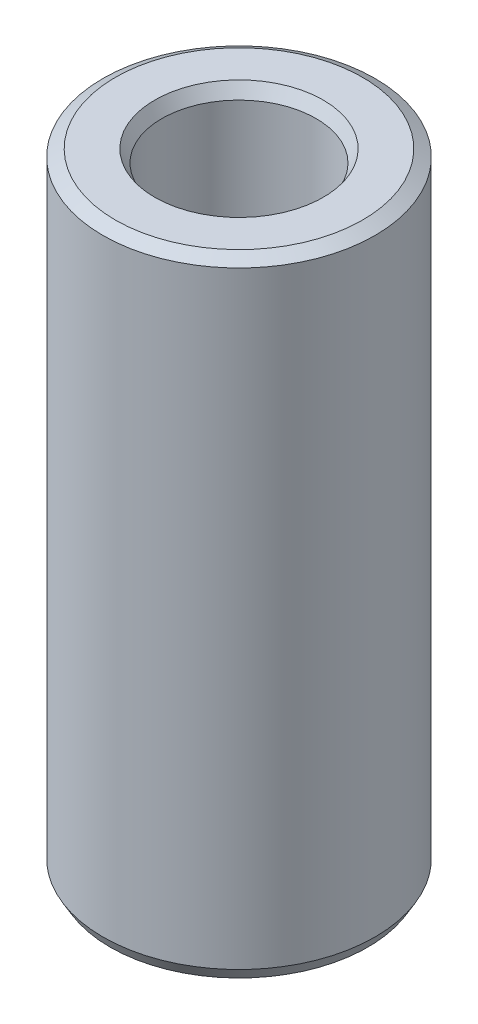
ISO-10303-21;
HEADER;
FILE_DESCRIPTION(('STEP AP214'),'2;1');
FILE_NAME('part.step','',(''),(''),'','','');
FILE_SCHEMA(('AUTOMOTIVE_DESIGN { 1 0 10303 214 1 1 1 1 }'));
ENDSEC;
DATA;
#1=APPLICATION_CONTEXT('core data for automotive mechanical design processes');
#2=APPLICATION_PROTOCOL_DEFINITION('international standard','automotive_design',2000,#1);
#3=PRODUCT_CONTEXT('',#1,'mechanical');
#4=PRODUCT('Part','Part','',(#3));
#5=PRODUCT_RELATED_PRODUCT_CATEGORY('part','',(#4));
#6=PRODUCT_DEFINITION_FORMATION('','',#4);
#7=PRODUCT_DEFINITION_CONTEXT('part definition',#1,'design');
#8=PRODUCT_DEFINITION('design','',#6,#7);
#9=PRODUCT_DEFINITION_SHAPE('','',#8);
#10=(LENGTH_UNIT() NAMED_UNIT(*) SI_UNIT(.MILLI.,.METRE.));
#11=(NAMED_UNIT(*) PLANE_ANGLE_UNIT() SI_UNIT($,.RADIAN.));
#12=(NAMED_UNIT(*) SI_UNIT($,.STERADIAN.) SOLID_ANGLE_UNIT());
#13=UNCERTAINTY_MEASURE_WITH_UNIT(LENGTH_MEASURE(1.E-05),#10,'distance_accuracy_value','');
#14=(GEOMETRIC_REPRESENTATION_CONTEXT(3) GLOBAL_UNCERTAINTY_ASSIGNED_CONTEXT((#13)) GLOBAL_UNIT_ASSIGNED_CONTEXT((#10,
#11,#12)) REPRESENTATION_CONTEXT('',''));
#15=CARTESIAN_POINT('',(0.,0.,0.));
#16=DIRECTION('',(0.,0.,1.));
#17=DIRECTION('',(1.,0.,0.));
#18=AXIS2_PLACEMENT_3D('',#15,#16,#17);
#19=CARTESIAN_POINT('',(0.,69.1482636736106,0.));
#20=DIRECTION('',(0.,-1.,0.));
#21=DIRECTION('',(0.,0.,-1.));
#22=AXIS2_PLACEMENT_3D('',#19,#20,#21);
#23=CYLINDRICAL_SURFACE('',#22,15.);
#24=CARTESIAN_POINT('',(0.,1.36794723579137,0.));
#25=DIRECTION('',(0.,1.,0.));
#26=DIRECTION('',(0.,0.,1.));
#27=AXIS2_PLACEMENT_3D('',#24,#25,#26);
#28=CIRCLE('',#27,15.);
#29=CARTESIAN_POINT('',(0.,1.36794723579137,15.));
#30=VERTEX_POINT('',#29);
#31=EDGE_CURVE('E10',#30,#30,#28,.T.);
#32=ORIENTED_EDGE('',*,*,#31,.T.);
#33=EDGE_LOOP('',(#32));
#34=FACE_BOUND('',#33,.T.);
#35=CARTESIAN_POINT('',(0.,68.3584789687892,0.));
#36=DIRECTION('',(0.,1.,0.));
#37=DIRECTION('',(0.,0.,1.));
#38=AXIS2_PLACEMENT_3D('',#35,#36,#37);
#39=CIRCLE('',#38,15.);
#40=CARTESIAN_POINT('',(0.,68.3584789687892,15.));
#41=VERTEX_POINT('',#40);
#42=EDGE_CURVE('E50',#41,#41,#39,.F.);
#43=ORIENTED_EDGE('',*,*,#42,.T.);
#44=EDGE_LOOP('',(#43));
#45=FACE_BOUND('',#44,.T.);
#46=ADVANCED_FACE('F39',(#34,#45),#23,.T.);
#47=CARTESIAN_POINT('',(0.,69.1482636736106,0.));
#48=DIRECTION('',(0.,1.,0.));
#49=DIRECTION('',(0.,0.,1.));
#50=AXIS2_PLACEMENT_3D('',#47,#48,#49);
#51=PLANE('',#50);
#52=CARTESIAN_POINT('',(0.,69.1482636736106,0.));
#53=DIRECTION('',(0.,1.,0.));
#54=DIRECTION('',(0.,0.,1.));
#55=AXIS2_PLACEMENT_3D('',#52,#53,#54);
#56=CIRCLE('',#55,9.29270970001012);
#57=CARTESIAN_POINT('',(0.,69.1482636736106,9.29270970001012));
#58=VERTEX_POINT('',#57);
#59=EDGE_CURVE('E58',#58,#58,#56,.F.);
#60=ORIENTED_EDGE('',*,*,#59,.T.);
#61=EDGE_LOOP('',(#60));
#62=FACE_BOUND('',#61,.T.);
#63=CARTESIAN_POINT('',(0.,69.1482636736106,0.));
#64=DIRECTION('',(0.,1.,0.));
#65=DIRECTION('',(0.,0.,1.));
#66=AXIS2_PLACEMENT_3D('',#63,#64,#65);
#67=CIRCLE('',#66,13.6320527642086);
#68=CARTESIAN_POINT('',(0.,69.1482636736106,13.6320527642086));
#69=VERTEX_POINT('',#68);
#70=EDGE_CURVE('E61',#69,#69,#67,.T.);
#71=ORIENTED_EDGE('',*,*,#70,.T.);
#72=EDGE_LOOP('',(#71));
#73=FACE_BOUND('',#72,.T.);
#74=ADVANCED_FACE('F88',(#62,#73),#51,.T.);
#75=CARTESIAN_POINT('',(0.,0.,0.));
#76=DIRECTION('',(0.,1.,0.));
#77=DIRECTION('',(0.,0.,1.));
#78=AXIS2_PLACEMENT_3D('',#75,#76,#77);
#79=PLANE('',#78);
#80=CARTESIAN_POINT('',(0.,0.,0.));
#81=DIRECTION('',(0.,1.,0.));
#82=DIRECTION('',(0.,0.,1.));
#83=AXIS2_PLACEMENT_3D('',#80,#81,#82);
#84=CIRCLE('',#83,9.87087223098012);
#85=CARTESIAN_POINT('',(0.,0.,9.87087223098012));
#86=VERTEX_POINT('',#85);
#87=EDGE_CURVE('E51',#86,#86,#84,.T.);
#88=ORIENTED_EDGE('',*,*,#87,.T.);
#89=EDGE_LOOP('',(#88));
#90=FACE_BOUND('',#89,.T.);
#91=CARTESIAN_POINT('',(0.,0.,0.));
#92=DIRECTION('',(0.,1.,0.));
#93=DIRECTION('',(0.,0.,1.));
#94=AXIS2_PLACEMENT_3D('',#91,#92,#93);
#95=CIRCLE('',#94,14.2102152951786);
#96=CARTESIAN_POINT('',(0.,0.,14.2102152951786));
#97=VERTEX_POINT('',#96);
#98=EDGE_CURVE('E54',#97,#97,#95,.F.);
#99=ORIENTED_EDGE('',*,*,#98,.T.);
#100=EDGE_LOOP('',(#99));
#101=FACE_BOUND('',#100,.T.);
#102=ADVANCED_FACE('F83',(#90,#101),#79,.F.);
#103=CARTESIAN_POINT('',(0.,69.1482636736106,0.));
#104=DIRECTION('',(0.,-1.,0.));
#105=DIRECTION('',(0.,0.,-1.));
#106=AXIS2_PLACEMENT_3D('',#103,#104,#105);
#107=CYLINDRICAL_SURFACE('',#106,8.50292499518875);
#108=CARTESIAN_POINT('',(0.,67.7803164378192,0.));
#109=DIRECTION('',(0.,1.,0.));
#110=DIRECTION('',(0.,0.,1.));
#111=AXIS2_PLACEMENT_3D('',#108,#109,#110);
#112=CIRCLE('',#111,8.50292499518875);
#113=CARTESIAN_POINT('',(0.,67.7803164378192,8.50292499518875));
#114=VERTEX_POINT('',#113);
#115=EDGE_CURVE('E67',#114,#114,#112,.T.);
#116=ORIENTED_EDGE('',*,*,#115,.T.);
#117=EDGE_LOOP('',(#116));
#118=FACE_BOUND('',#117,.T.);
#119=CARTESIAN_POINT('',(0.,0.789784704821356,0.));
#120=DIRECTION('',(0.,1.,0.));
#121=DIRECTION('',(0.,0.,1.));
#122=AXIS2_PLACEMENT_3D('',#119,#120,#121);
#123=CIRCLE('',#122,8.50292499518875);
#124=CARTESIAN_POINT('',(0.,0.789784704821356,8.50292499518875));
#125=VERTEX_POINT('',#124);
#126=EDGE_CURVE('E69',#125,#125,#123,.F.);
#127=ORIENTED_EDGE('',*,*,#126,.T.);
#128=EDGE_LOOP('',(#127));
#129=FACE_BOUND('',#128,.T.);
#130=ADVANCED_FACE('F71',(#118,#129),#107,.F.);
#131=CARTESIAN_POINT('',(0.,67.7803164378192,0.));
#132=DIRECTION('',(0.,1.,0.));
#133=DIRECTION('',(0.,0.,1.));
#134=AXIS2_PLACEMENT_3D('',#131,#132,#133);
#135=CONICAL_SURFACE('',#134,8.50292499518875,0.523598775598301);
#136=ORIENTED_EDGE('',*,*,#59,.F.);
#137=EDGE_LOOP('',(#136));
#138=FACE_BOUND('',#137,.T.);
#139=ORIENTED_EDGE('',*,*,#115,.F.);
#140=EDGE_LOOP('',(#139));
#141=FACE_BOUND('',#140,.T.);
#142=ADVANCED_FACE('F77',(#138,#141),#135,.F.);
#143=CARTESIAN_POINT('',(0.,0.,0.));
#144=DIRECTION('',(0.,-1.,0.));
#145=DIRECTION('',(0.,0.,-1.));
#146=AXIS2_PLACEMENT_3D('',#143,#144,#145);
#147=CONICAL_SURFACE('',#146,9.87087223098012,1.04719755119659);
#148=ORIENTED_EDGE('',*,*,#126,.F.);
#149=EDGE_LOOP('',(#148));
#150=FACE_BOUND('',#149,.T.);
#151=ORIENTED_EDGE('',*,*,#87,.F.);
#152=EDGE_LOOP('',(#151));
#153=FACE_BOUND('',#152,.T.);
#154=ADVANCED_FACE('F73',(#150,#153),#147,.F.);
#155=CARTESIAN_POINT('',(0.,1.36794723579137,0.));
#156=DIRECTION('',(0.,1.,0.));
#157=DIRECTION('',(0.,0.,1.));
#158=AXIS2_PLACEMENT_3D('',#155,#156,#157);
#159=CONICAL_SURFACE('',#158,15.,0.523598775598304);
#160=ORIENTED_EDGE('',*,*,#98,.F.);
#161=EDGE_LOOP('',(#160));
#162=FACE_BOUND('',#161,.T.);
#163=ORIENTED_EDGE('',*,*,#31,.F.);
#164=EDGE_LOOP('',(#163));
#165=FACE_BOUND('',#164,.T.);
#166=ADVANCED_FACE('F76',(#162,#165),#159,.T.);
#167=CARTESIAN_POINT('',(0.,69.1482636736106,0.));
#168=DIRECTION('',(0.,-1.,0.));
#169=DIRECTION('',(0.,0.,-1.));
#170=AXIS2_PLACEMENT_3D('',#167,#168,#169);
#171=CONICAL_SURFACE('',#170,13.6320527642086,1.04719755119659);
#172=ORIENTED_EDGE('',*,*,#42,.F.);
#173=EDGE_LOOP('',(#172));
#174=FACE_BOUND('',#173,.T.);
#175=ORIENTED_EDGE('',*,*,#70,.F.);
#176=EDGE_LOOP('',(#175));
#177=FACE_BOUND('',#176,.T.);
#178=ADVANCED_FACE('F45',(#174,#177),#171,.T.);
#179=CLOSED_SHELL('',(#46,#74,#102,#130,#142,#154,#166,#178));
#180=MANIFOLD_SOLID_BREP('B2',#179);
#181=ADVANCED_BREP_SHAPE_REPRESENTATION('',(#18,#180),#14);
#182=SHAPE_DEFINITION_REPRESENTATION(#9,#181);
ENDSEC;
END-ISO-10303-21;
